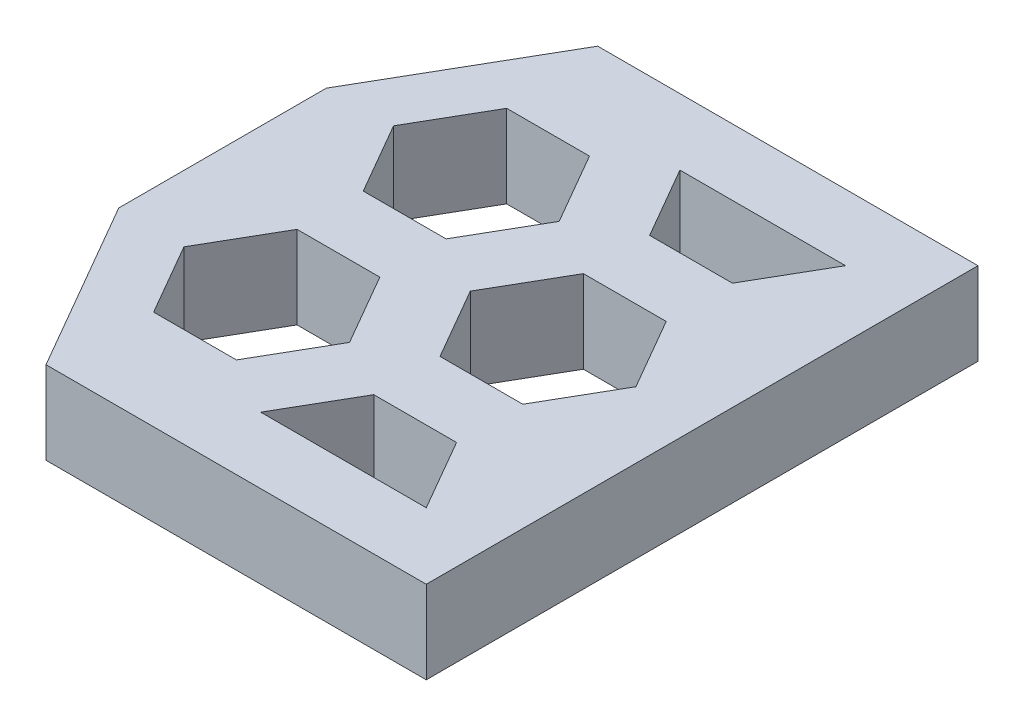
ISO-10303-21;
HEADER;
FILE_DESCRIPTION(('STEP AP214'),'2;1');
FILE_NAME('part.step','',(''),(''),'','','');
FILE_SCHEMA(('AUTOMOTIVE_DESIGN { 1 0 10303 214 1 1 1 1 }'));
ENDSEC;
DATA;
#1=APPLICATION_CONTEXT('core data for automotive mechanical design processes');
#2=APPLICATION_PROTOCOL_DEFINITION('international standard','automotive_design',2000,#1);
#3=PRODUCT_CONTEXT('',#1,'mechanical');
#4=PRODUCT('Part','Part','',(#3));
#5=PRODUCT_RELATED_PRODUCT_CATEGORY('part','',(#4));
#6=PRODUCT_DEFINITION_FORMATION('','',#4);
#7=PRODUCT_DEFINITION_CONTEXT('part definition',#1,'design');
#8=PRODUCT_DEFINITION('design','',#6,#7);
#9=PRODUCT_DEFINITION_SHAPE('','',#8);
#10=(LENGTH_UNIT() NAMED_UNIT(*) SI_UNIT(.MILLI.,.METRE.));
#11=(NAMED_UNIT(*) PLANE_ANGLE_UNIT() SI_UNIT($,.RADIAN.));
#12=(NAMED_UNIT(*) SI_UNIT($,.STERADIAN.) SOLID_ANGLE_UNIT());
#13=UNCERTAINTY_MEASURE_WITH_UNIT(LENGTH_MEASURE(1.E-05),#10,'distance_accuracy_value','');
#14=(GEOMETRIC_REPRESENTATION_CONTEXT(3) GLOBAL_UNCERTAINTY_ASSIGNED_CONTEXT((#13)) GLOBAL_UNIT_ASSIGNED_CONTEXT((#10,
#11,#12)) REPRESENTATION_CONTEXT('',''));
#15=CARTESIAN_POINT('',(0.,0.,0.));
#16=DIRECTION('',(0.,0.,1.));
#17=DIRECTION('',(1.,0.,0.));
#18=AXIS2_PLACEMENT_3D('',#15,#16,#17);
#19=CARTESIAN_POINT('',(0.,2.5,0.));
#20=DIRECTION('',(0.,-1.,0.));
#21=DIRECTION('',(0.,0.,-1.));
#22=AXIS2_PLACEMENT_3D('',#19,#20,#21);
#23=PLANE('',#22);
#24=DIRECTION('',(0.5,0.,-0.866025403784438));
#25=VECTOR('',#24,1.);
#26=CARTESIAN_POINT('',(11.2320508075689,2.5,-12.4951905283833));
#27=LINE('',#26,#25);
#28=CARTESIAN_POINT('',(11.2320508075689,2.5,-12.4951905283833));
#29=VERTEX_POINT('',#28);
#30=CARTESIAN_POINT('',(12.4820508075689,2.5,-14.6602540378444));
#31=VERTEX_POINT('',#30);
#32=EDGE_CURVE('E314',#29,#31,#27,.T.);
#33=ORIENTED_EDGE('',*,*,#32,.F.);
#34=DIRECTION('',(1.,0.,0.));
#35=VECTOR('',#34,1.);
#36=CARTESIAN_POINT('',(8.73205080756887,2.5,-12.4951905283833));
#37=LINE('',#36,#35);
#38=CARTESIAN_POINT('',(8.73205080756887,2.5,-12.4951905283833));
#39=VERTEX_POINT('',#38);
#40=EDGE_CURVE('E325',#39,#29,#37,.T.);
#41=ORIENTED_EDGE('',*,*,#40,.F.);
#42=DIRECTION('',(0.500000000000001,0.,0.866025403784438));
#43=VECTOR('',#42,1.);
#44=CARTESIAN_POINT('',(7.48205080756886,2.5,-14.6602540378444));
#45=LINE('',#44,#43);
#46=CARTESIAN_POINT('',(7.48205080756886,2.5,-14.6602540378444));
#47=VERTEX_POINT('',#46);
#48=EDGE_CURVE('E321',#47,#39,#45,.T.);
#49=ORIENTED_EDGE('',*,*,#48,.F.);
#50=DIRECTION('',(-1.,0.,0.));
#51=VECTOR('',#50,1.);
#52=CARTESIAN_POINT('',(7.48205080756886,2.5,-14.6602540378444));
#53=LINE('',#52,#51);
#54=EDGE_CURVE('E317',#31,#47,#53,.T.);
#55=ORIENTED_EDGE('',*,*,#54,.F.);
#56=EDGE_LOOP('',(#33,#41,#49,#55));
#57=FACE_BOUND('',#56,.T.);
#58=DIRECTION('',(0.5,0.,-0.866025403784439));
#59=VECTOR('',#58,1.);
#60=CARTESIAN_POINT('',(5.75,2.5,-2.99999999999998));
#61=LINE('',#60,#59);
#62=CARTESIAN_POINT('',(5.75,2.5,-2.99999999999998));
#63=VERTEX_POINT('',#62);
#64=CARTESIAN_POINT('',(7.,2.5,-5.16506350946108));
#65=VERTEX_POINT('',#64);
#66=EDGE_CURVE('E420',#63,#65,#61,.T.);
#67=ORIENTED_EDGE('',*,*,#66,.F.);
#68=DIRECTION('',(1.,0.,0.));
#69=VECTOR('',#68,1.);
#70=CARTESIAN_POINT('',(3.25,2.5,-2.99999999999998));
#71=LINE('',#70,#69);
#72=CARTESIAN_POINT('',(3.25,2.5,-2.99999999999998));
#73=VERTEX_POINT('',#72);
#74=EDGE_CURVE('E437',#73,#63,#71,.T.);
#75=ORIENTED_EDGE('',*,*,#74,.F.);
#76=DIRECTION('',(0.5,0.,0.866025403784439));
#77=VECTOR('',#76,1.);
#78=CARTESIAN_POINT('',(2.,2.5,-5.16506350946108));
#79=LINE('',#78,#77);
#80=CARTESIAN_POINT('',(2.,2.5,-5.16506350946108));
#81=VERTEX_POINT('',#80);
#82=EDGE_CURVE('E433',#81,#73,#79,.T.);
#83=ORIENTED_EDGE('',*,*,#82,.F.);
#84=DIRECTION('',(-0.5,0.,0.866025403784439));
#85=VECTOR('',#84,1.);
#86=CARTESIAN_POINT('',(3.25,2.5,-7.33012701892218));
#87=LINE('',#86,#85);
#88=CARTESIAN_POINT('',(3.25,2.5,-7.33012701892218));
#89=VERTEX_POINT('',#88);
#90=EDGE_CURVE('E430',#89,#81,#87,.T.);
#91=ORIENTED_EDGE('',*,*,#90,.F.);
#92=DIRECTION('',(-1.,0.,0.));
#93=VECTOR('',#92,1.);
#94=CARTESIAN_POINT('',(5.75,2.5,-7.33012701892218));
#95=LINE('',#94,#93);
#96=CARTESIAN_POINT('',(5.75,2.5,-7.33012701892218));
#97=VERTEX_POINT('',#96);
#98=EDGE_CURVE('E427',#97,#89,#95,.T.);
#99=ORIENTED_EDGE('',*,*,#98,.F.);
#100=DIRECTION('',(-0.5,0.,-0.866025403784439));
#101=VECTOR('',#100,1.);
#102=CARTESIAN_POINT('',(7.,2.5,-5.16506350946108));
#103=LINE('',#102,#101);
#104=EDGE_CURVE('E423',#65,#97,#103,.T.);
#105=ORIENTED_EDGE('',*,*,#104,.F.);
#106=EDGE_LOOP('',(#67,#75,#83,#91,#99,#105));
#107=FACE_BOUND('',#106,.T.);
#108=DIRECTION('',(0.,0.,1.));
#109=VECTOR('',#108,1.);
#110=CARTESIAN_POINT('',(0.,2.5,0.));
#111=LINE('',#110,#109);
#112=CARTESIAN_POINT('',(0.,2.5,-11.4641016151378));
#113=VERTEX_POINT('',#112);
#114=CARTESIAN_POINT('',(0.,2.5,-5.19615242270663));
#115=VERTEX_POINT('',#114);
#116=EDGE_CURVE('E546',#113,#115,#111,.T.);
#117=ORIENTED_EDGE('',*,*,#116,.T.);
#118=DIRECTION('',(-0.500000000000001,0.,-0.866025403784438));
#119=VECTOR('',#118,1.);
#120=CARTESIAN_POINT('',(3.00000000000001,2.5,0.));
#121=LINE('',#120,#119);
#122=CARTESIAN_POINT('',(3.00000000000001,2.5,0.));
#123=VERTEX_POINT('',#122);
#124=EDGE_CURVE('E57',#115,#123,#121,.F.);
#125=ORIENTED_EDGE('',*,*,#124,.T.);
#126=DIRECTION('',(1.,0.,0.));
#127=VECTOR('',#126,1.);
#128=CARTESIAN_POINT('',(0.,2.5,0.));
#129=LINE('',#128,#127);
#130=CARTESIAN_POINT('',(14.4820508075689,2.5,0.));
#131=VERTEX_POINT('',#130);
#132=EDGE_CURVE('E549',#123,#131,#129,.T.);
#133=ORIENTED_EDGE('',*,*,#132,.T.);
#134=DIRECTION('',(0.,0.,-1.));
#135=VECTOR('',#134,1.);
#136=CARTESIAN_POINT('',(14.4820508075689,2.5,0.));
#137=LINE('',#136,#135);
#138=CARTESIAN_POINT('',(14.4820508075689,2.5,-16.6602540378444));
#139=VERTEX_POINT('',#138);
#140=EDGE_CURVE('E553',#131,#139,#137,.T.);
#141=ORIENTED_EDGE('',*,*,#140,.T.);
#142=DIRECTION('',(-1.,0.,0.));
#143=VECTOR('',#142,1.);
#144=CARTESIAN_POINT('',(0.,2.5,-16.6602540378444));
#145=LINE('',#144,#143);
#146=CARTESIAN_POINT('',(3.,2.5,-16.6602540378444));
#147=VERTEX_POINT('',#146);
#148=EDGE_CURVE('E556',#139,#147,#145,.T.);
#149=ORIENTED_EDGE('',*,*,#148,.T.);
#150=DIRECTION('',(0.500000000000001,0.,-0.866025403784438));
#151=VECTOR('',#150,1.);
#152=CARTESIAN_POINT('',(0.,2.5,-11.4641016151378));
#153=LINE('',#152,#151);
#154=EDGE_CURVE('E593',#147,#113,#153,.F.);
#155=ORIENTED_EDGE('',*,*,#154,.T.);
#156=EDGE_LOOP('',(#117,#125,#133,#141,#149,#155));
#157=FACE_BOUND('',#156,.T.);
#158=DIRECTION('',(0.5,0.,-0.866025403784439));
#159=VECTOR('',#158,1.);
#160=CARTESIAN_POINT('',(5.74999999999999,2.5,-9.33012701892219));
#161=LINE('',#160,#159);
#162=CARTESIAN_POINT('',(5.74999999999999,2.5,-9.33012701892219));
#163=VERTEX_POINT('',#162);
#164=CARTESIAN_POINT('',(6.99999999999999,2.5,-11.4951905283833));
#165=VERTEX_POINT('',#164);
#166=EDGE_CURVE('E483',#163,#165,#161,.T.);
#167=ORIENTED_EDGE('',*,*,#166,.F.);
#168=DIRECTION('',(1.,0.,0.));
#169=VECTOR('',#168,1.);
#170=CARTESIAN_POINT('',(3.25,2.5,-9.33012701892219));
#171=LINE('',#170,#169);
#172=CARTESIAN_POINT('',(3.25,2.5,-9.33012701892219));
#173=VERTEX_POINT('',#172);
#174=EDGE_CURVE('E500',#173,#163,#171,.T.);
#175=ORIENTED_EDGE('',*,*,#174,.F.);
#176=DIRECTION('',(0.5,0.,0.866025403784439));
#177=VECTOR('',#176,1.);
#178=CARTESIAN_POINT('',(2.,2.5,-11.4951905283833));
#179=LINE('',#178,#177);
#180=CARTESIAN_POINT('',(2.,2.5,-11.4951905283833));
#181=VERTEX_POINT('',#180);
#182=EDGE_CURVE('E496',#181,#173,#179,.T.);
#183=ORIENTED_EDGE('',*,*,#182,.F.);
#184=DIRECTION('',(-0.5,0.,0.866025403784439));
#185=VECTOR('',#184,1.);
#186=CARTESIAN_POINT('',(3.25,2.5,-13.6602540378444));
#187=LINE('',#186,#185);
#188=CARTESIAN_POINT('',(3.25,2.5,-13.6602540378444));
#189=VERTEX_POINT('',#188);
#190=EDGE_CURVE('E493',#189,#181,#187,.T.);
#191=ORIENTED_EDGE('',*,*,#190,.F.);
#192=DIRECTION('',(-1.,0.,0.));
#193=VECTOR('',#192,1.);
#194=CARTESIAN_POINT('',(5.75,2.5,-13.6602540378444));
#195=LINE('',#194,#193);
#196=CARTESIAN_POINT('',(5.75,2.5,-13.6602540378444));
#197=VERTEX_POINT('',#196);
#198=EDGE_CURVE('E490',#197,#189,#195,.T.);
#199=ORIENTED_EDGE('',*,*,#198,.F.);
#200=DIRECTION('',(-0.5,0.,-0.866025403784438));
#201=VECTOR('',#200,1.);
#202=CARTESIAN_POINT('',(6.99999999999999,2.5,-11.4951905283833));
#203=LINE('',#202,#201);
#204=EDGE_CURVE('E486',#165,#197,#203,.T.);
#205=ORIENTED_EDGE('',*,*,#204,.F.);
#206=EDGE_LOOP('',(#167,#175,#183,#191,#199,#205));
#207=FACE_BOUND('',#206,.T.);
#208=DIRECTION('',(0.5,0.,-0.866025403784439));
#209=VECTOR('',#208,1.);
#210=CARTESIAN_POINT('',(11.2320508075689,2.5,-6.1650635094611));
#211=LINE('',#210,#209);
#212=CARTESIAN_POINT('',(11.2320508075689,2.5,-6.1650635094611));
#213=VERTEX_POINT('',#212);
#214=CARTESIAN_POINT('',(12.4820508075689,2.5,-8.33012701892219));
#215=VERTEX_POINT('',#214);
#216=EDGE_CURVE('E357',#213,#215,#211,.T.);
#217=ORIENTED_EDGE('',*,*,#216,.F.);
#218=DIRECTION('',(1.,0.,0.));
#219=VECTOR('',#218,1.);
#220=CARTESIAN_POINT('',(8.73205080756887,2.5,-6.1650635094611));
#221=LINE('',#220,#219);
#222=CARTESIAN_POINT('',(8.73205080756887,2.5,-6.1650635094611));
#223=VERTEX_POINT('',#222);
#224=EDGE_CURVE('E374',#223,#213,#221,.T.);
#225=ORIENTED_EDGE('',*,*,#224,.F.);
#226=DIRECTION('',(0.5,0.,0.866025403784439));
#227=VECTOR('',#226,1.);
#228=CARTESIAN_POINT('',(7.48205080756887,2.5,-8.33012701892219));
#229=LINE('',#228,#227);
#230=CARTESIAN_POINT('',(7.48205080756887,2.5,-8.33012701892219));
#231=VERTEX_POINT('',#230);
#232=EDGE_CURVE('E370',#231,#223,#229,.T.);
#233=ORIENTED_EDGE('',*,*,#232,.F.);
#234=DIRECTION('',(-0.5,0.,0.866025403784439));
#235=VECTOR('',#234,1.);
#236=CARTESIAN_POINT('',(8.73205080756887,2.5,-10.4951905283833));
#237=LINE('',#236,#235);
#238=CARTESIAN_POINT('',(8.73205080756887,2.5,-10.4951905283833));
#239=VERTEX_POINT('',#238);
#240=EDGE_CURVE('E367',#239,#231,#237,.T.);
#241=ORIENTED_EDGE('',*,*,#240,.F.);
#242=DIRECTION('',(-1.,0.,0.));
#243=VECTOR('',#242,1.);
#244=CARTESIAN_POINT('',(11.2320508075689,2.5,-10.4951905283833));
#245=LINE('',#244,#243);
#246=CARTESIAN_POINT('',(11.2320508075689,2.5,-10.4951905283833));
#247=VERTEX_POINT('',#246);
#248=EDGE_CURVE('E364',#247,#239,#245,.T.);
#249=ORIENTED_EDGE('',*,*,#248,.F.);
#250=DIRECTION('',(-0.5,0.,-0.866025403784438));
#251=VECTOR('',#250,1.);
#252=CARTESIAN_POINT('',(12.4820508075689,2.5,-8.33012701892219));
#253=LINE('',#252,#251);
#254=EDGE_CURVE('E360',#215,#247,#253,.T.);
#255=ORIENTED_EDGE('',*,*,#254,.F.);
#256=EDGE_LOOP('',(#217,#225,#233,#241,#249,#255));
#257=FACE_BOUND('',#256,.T.);
#258=DIRECTION('',(-0.499999999999999,0.,-0.866025403784439));
#259=VECTOR('',#258,1.);
#260=CARTESIAN_POINT('',(12.4820508075689,2.5,-2.));
#261=LINE('',#260,#259);
#262=CARTESIAN_POINT('',(12.4820508075689,2.5,-2.));
#263=VERTEX_POINT('',#262);
#264=CARTESIAN_POINT('',(11.2320508075689,2.5,-4.1650635094611));
#265=VERTEX_POINT('',#264);
#266=EDGE_CURVE('E261',#263,#265,#261,.T.);
#267=ORIENTED_EDGE('',*,*,#266,.F.);
#268=DIRECTION('',(1.,0.,0.));
#269=VECTOR('',#268,1.);
#270=CARTESIAN_POINT('',(7.48205080756889,2.5,-2.));
#271=LINE('',#270,#269);
#272=CARTESIAN_POINT('',(7.48205080756889,2.5,-2.));
#273=VERTEX_POINT('',#272);
#274=EDGE_CURVE('E290',#273,#263,#271,.T.);
#275=ORIENTED_EDGE('',*,*,#274,.F.);
#276=DIRECTION('',(-0.5,0.,0.866025403784439));
#277=VECTOR('',#276,1.);
#278=CARTESIAN_POINT('',(8.73205080756889,2.5,-4.1650635094611));
#279=LINE('',#278,#277);
#280=CARTESIAN_POINT('',(8.73205080756889,2.5,-4.1650635094611));
#281=VERTEX_POINT('',#280);
#282=EDGE_CURVE('E286',#281,#273,#279,.T.);
#283=ORIENTED_EDGE('',*,*,#282,.F.);
#284=DIRECTION('',(-1.,0.,0.));
#285=VECTOR('',#284,1.);
#286=CARTESIAN_POINT('',(11.2320508075689,2.5,-4.1650635094611));
#287=LINE('',#286,#285);
#288=EDGE_CURVE('E272',#265,#281,#287,.T.);
#289=ORIENTED_EDGE('',*,*,#288,.F.);
#290=EDGE_LOOP('',(#267,#275,#283,#289));
#291=FACE_BOUND('',#290,.T.);
#292=ADVANCED_FACE('F47',(#57,#107,#157,#207,#257,#291),#23,.F.);
#293=CARTESIAN_POINT('',(0.,0.,0.));
#294=DIRECTION('',(0.,-1.,0.));
#295=DIRECTION('',(0.,0.,-1.));
#296=AXIS2_PLACEMENT_3D('',#293,#294,#295);
#297=PLANE('',#296);
#298=DIRECTION('',(1.,0.,0.));
#299=VECTOR('',#298,1.);
#300=CARTESIAN_POINT('',(0.,0.,0.));
#301=LINE('',#300,#299);
#302=CARTESIAN_POINT('',(3.00000000000001,0.,0.));
#303=VERTEX_POINT('',#302);
#304=CARTESIAN_POINT('',(14.4820508075689,0.,0.));
#305=VERTEX_POINT('',#304);
#306=EDGE_CURVE('E562',#303,#305,#301,.T.);
#307=ORIENTED_EDGE('',*,*,#306,.F.);
#308=DIRECTION('',(0.500000000000001,0.,0.866025403784438));
#309=VECTOR('',#308,1.);
#310=CARTESIAN_POINT('',(2.25,0.,-1.29903810567666));
#311=LINE('',#310,#309);
#312=CARTESIAN_POINT('',(0.,0.,-5.19615242270663));
#313=VERTEX_POINT('',#312);
#314=EDGE_CURVE('E584',#303,#313,#311,.F.);
#315=ORIENTED_EDGE('',*,*,#314,.T.);
#316=DIRECTION('',(0.,0.,1.));
#317=VECTOR('',#316,1.);
#318=CARTESIAN_POINT('',(0.,0.,0.));
#319=LINE('',#318,#317);
#320=CARTESIAN_POINT('',(0.,0.,-11.4641016151378));
#321=VERTEX_POINT('',#320);
#322=EDGE_CURVE('E545',#321,#313,#319,.T.);
#323=ORIENTED_EDGE('',*,*,#322,.F.);
#324=DIRECTION('',(-0.500000000000001,0.,0.866025403784438));
#325=VECTOR('',#324,1.);
#326=CARTESIAN_POINT('',(-4.96410161513776,0.,-2.86602540378445));
#327=LINE('',#326,#325);
#328=CARTESIAN_POINT('',(3.,0.,-16.6602540378444));
#329=VERTEX_POINT('',#328);
#330=EDGE_CURVE('E581',#321,#329,#327,.F.);
#331=ORIENTED_EDGE('',*,*,#330,.T.);
#332=DIRECTION('',(-1.,0.,0.));
#333=VECTOR('',#332,1.);
#334=CARTESIAN_POINT('',(0.,0.,-16.6602540378444));
#335=LINE('',#334,#333);
#336=CARTESIAN_POINT('',(14.4820508075689,0.,-16.6602540378444));
#337=VERTEX_POINT('',#336);
#338=EDGE_CURVE('E550',#337,#329,#335,.T.);
#339=ORIENTED_EDGE('',*,*,#338,.F.);
#340=DIRECTION('',(0.,0.,-1.));
#341=VECTOR('',#340,1.);
#342=CARTESIAN_POINT('',(14.4820508075689,0.,0.));
#343=LINE('',#342,#341);
#344=EDGE_CURVE('E565',#305,#337,#343,.T.);
#345=ORIENTED_EDGE('',*,*,#344,.F.);
#346=EDGE_LOOP('',(#307,#315,#323,#331,#339,#345));
#347=FACE_BOUND('',#346,.T.);
#348=DIRECTION('',(1.,0.,0.));
#349=VECTOR('',#348,1.);
#350=CARTESIAN_POINT('',(3.25,0.,-9.33012701892219));
#351=LINE('',#350,#349);
#352=CARTESIAN_POINT('',(3.25,0.,-9.33012701892219));
#353=VERTEX_POINT('',#352);
#354=CARTESIAN_POINT('',(5.74999999999999,0.,-9.33012701892219));
#355=VERTEX_POINT('',#354);
#356=EDGE_CURVE('E487',#353,#355,#351,.T.);
#357=ORIENTED_EDGE('',*,*,#356,.T.);
#358=DIRECTION('',(0.5,0.,-0.866025403784439));
#359=VECTOR('',#358,1.);
#360=CARTESIAN_POINT('',(5.74999999999999,0.,-9.33012701892219));
#361=LINE('',#360,#359);
#362=CARTESIAN_POINT('',(6.99999999999999,0.,-11.4951905283833));
#363=VERTEX_POINT('',#362);
#364=EDGE_CURVE('E482',#355,#363,#361,.T.);
#365=ORIENTED_EDGE('',*,*,#364,.T.);
#366=DIRECTION('',(-0.5,0.,-0.866025403784438));
#367=VECTOR('',#366,1.);
#368=CARTESIAN_POINT('',(6.99999999999999,0.,-11.4951905283833));
#369=LINE('',#368,#367);
#370=CARTESIAN_POINT('',(5.75,0.,-13.6602540378444));
#371=VERTEX_POINT('',#370);
#372=EDGE_CURVE('E507',#363,#371,#369,.T.);
#373=ORIENTED_EDGE('',*,*,#372,.T.);
#374=DIRECTION('',(-1.,0.,0.));
#375=VECTOR('',#374,1.);
#376=CARTESIAN_POINT('',(5.75,0.,-13.6602540378444));
#377=LINE('',#376,#375);
#378=CARTESIAN_POINT('',(3.25,0.,-13.6602540378444));
#379=VERTEX_POINT('',#378);
#380=EDGE_CURVE('E511',#371,#379,#377,.T.);
#381=ORIENTED_EDGE('',*,*,#380,.T.);
#382=DIRECTION('',(-0.5,0.,0.866025403784439));
#383=VECTOR('',#382,1.);
#384=CARTESIAN_POINT('',(3.25,0.,-13.6602540378444));
#385=LINE('',#384,#383);
#386=CARTESIAN_POINT('',(2.,0.,-11.4951905283833));
#387=VERTEX_POINT('',#386);
#388=EDGE_CURVE('E515',#379,#387,#385,.T.);
#389=ORIENTED_EDGE('',*,*,#388,.T.);
#390=DIRECTION('',(0.5,0.,0.866025403784439));
#391=VECTOR('',#390,1.);
#392=CARTESIAN_POINT('',(2.,0.,-11.4951905283833));
#393=LINE('',#392,#391);
#394=EDGE_CURVE('E519',#387,#353,#393,.T.);
#395=ORIENTED_EDGE('',*,*,#394,.T.);
#396=EDGE_LOOP('',(#357,#365,#373,#381,#389,#395));
#397=FACE_BOUND('',#396,.T.);
#398=DIRECTION('',(1.,0.,0.));
#399=VECTOR('',#398,1.);
#400=CARTESIAN_POINT('',(3.25,0.,-2.99999999999998));
#401=LINE('',#400,#399);
#402=CARTESIAN_POINT('',(3.25,0.,-2.99999999999998));
#403=VERTEX_POINT('',#402);
#404=CARTESIAN_POINT('',(5.75,0.,-2.99999999999998));
#405=VERTEX_POINT('',#404);
#406=EDGE_CURVE('E424',#403,#405,#401,.T.);
#407=ORIENTED_EDGE('',*,*,#406,.T.);
#408=DIRECTION('',(0.5,0.,-0.866025403784439));
#409=VECTOR('',#408,1.);
#410=CARTESIAN_POINT('',(5.75,0.,-2.99999999999998));
#411=LINE('',#410,#409);
#412=CARTESIAN_POINT('',(7.,0.,-5.16506350946108));
#413=VERTEX_POINT('',#412);
#414=EDGE_CURVE('E419',#405,#413,#411,.T.);
#415=ORIENTED_EDGE('',*,*,#414,.T.);
#416=DIRECTION('',(-0.5,0.,-0.866025403784439));
#417=VECTOR('',#416,1.);
#418=CARTESIAN_POINT('',(7.,0.,-5.16506350946108));
#419=LINE('',#418,#417);
#420=CARTESIAN_POINT('',(5.75,0.,-7.33012701892218));
#421=VERTEX_POINT('',#420);
#422=EDGE_CURVE('E444',#413,#421,#419,.T.);
#423=ORIENTED_EDGE('',*,*,#422,.T.);
#424=DIRECTION('',(-1.,0.,0.));
#425=VECTOR('',#424,1.);
#426=CARTESIAN_POINT('',(5.75,0.,-7.33012701892218));
#427=LINE('',#426,#425);
#428=CARTESIAN_POINT('',(3.25,0.,-7.33012701892218));
#429=VERTEX_POINT('',#428);
#430=EDGE_CURVE('E448',#421,#429,#427,.T.);
#431=ORIENTED_EDGE('',*,*,#430,.T.);
#432=DIRECTION('',(-0.5,0.,0.866025403784439));
#433=VECTOR('',#432,1.);
#434=CARTESIAN_POINT('',(3.25,0.,-7.33012701892218));
#435=LINE('',#434,#433);
#436=CARTESIAN_POINT('',(2.,0.,-5.16506350946108));
#437=VERTEX_POINT('',#436);
#438=EDGE_CURVE('E452',#429,#437,#435,.T.);
#439=ORIENTED_EDGE('',*,*,#438,.T.);
#440=DIRECTION('',(0.5,0.,0.866025403784439));
#441=VECTOR('',#440,1.);
#442=CARTESIAN_POINT('',(2.,0.,-5.16506350946108));
#443=LINE('',#442,#441);
#444=EDGE_CURVE('E456',#437,#403,#443,.T.);
#445=ORIENTED_EDGE('',*,*,#444,.T.);
#446=EDGE_LOOP('',(#407,#415,#423,#431,#439,#445));
#447=FACE_BOUND('',#446,.T.);
#448=DIRECTION('',(1.,0.,0.));
#449=VECTOR('',#448,1.);
#450=CARTESIAN_POINT('',(8.73205080756887,0.,-6.1650635094611));
#451=LINE('',#450,#449);
#452=CARTESIAN_POINT('',(8.73205080756887,0.,-6.1650635094611));
#453=VERTEX_POINT('',#452);
#454=CARTESIAN_POINT('',(11.2320508075689,0.,-6.1650635094611));
#455=VERTEX_POINT('',#454);
#456=EDGE_CURVE('E361',#453,#455,#451,.T.);
#457=ORIENTED_EDGE('',*,*,#456,.T.);
#458=DIRECTION('',(0.5,0.,-0.866025403784439));
#459=VECTOR('',#458,1.);
#460=CARTESIAN_POINT('',(11.2320508075689,0.,-6.1650635094611));
#461=LINE('',#460,#459);
#462=CARTESIAN_POINT('',(12.4820508075689,0.,-8.33012701892219));
#463=VERTEX_POINT('',#462);
#464=EDGE_CURVE('E356',#455,#463,#461,.T.);
#465=ORIENTED_EDGE('',*,*,#464,.T.);
#466=DIRECTION('',(-0.5,0.,-0.866025403784438));
#467=VECTOR('',#466,1.);
#468=CARTESIAN_POINT('',(12.4820508075689,0.,-8.33012701892219));
#469=LINE('',#468,#467);
#470=CARTESIAN_POINT('',(11.2320508075689,0.,-10.4951905283833));
#471=VERTEX_POINT('',#470);
#472=EDGE_CURVE('E381',#463,#471,#469,.T.);
#473=ORIENTED_EDGE('',*,*,#472,.T.);
#474=DIRECTION('',(-1.,0.,0.));
#475=VECTOR('',#474,1.);
#476=CARTESIAN_POINT('',(11.2320508075689,0.,-10.4951905283833));
#477=LINE('',#476,#475);
#478=CARTESIAN_POINT('',(8.73205080756887,0.,-10.4951905283833));
#479=VERTEX_POINT('',#478);
#480=EDGE_CURVE('E385',#471,#479,#477,.T.);
#481=ORIENTED_EDGE('',*,*,#480,.T.);
#482=DIRECTION('',(-0.5,0.,0.866025403784439));
#483=VECTOR('',#482,1.);
#484=CARTESIAN_POINT('',(8.73205080756887,0.,-10.4951905283833));
#485=LINE('',#484,#483);
#486=CARTESIAN_POINT('',(7.48205080756887,0.,-8.33012701892219));
#487=VERTEX_POINT('',#486);
#488=EDGE_CURVE('E389',#479,#487,#485,.T.);
#489=ORIENTED_EDGE('',*,*,#488,.T.);
#490=DIRECTION('',(0.5,0.,0.866025403784439));
#491=VECTOR('',#490,1.);
#492=CARTESIAN_POINT('',(7.48205080756887,0.,-8.33012701892219));
#493=LINE('',#492,#491);
#494=EDGE_CURVE('E393',#487,#453,#493,.T.);
#495=ORIENTED_EDGE('',*,*,#494,.T.);
#496=EDGE_LOOP('',(#457,#465,#473,#481,#489,#495));
#497=FACE_BOUND('',#496,.T.);
#498=DIRECTION('',(1.,0.,0.));
#499=VECTOR('',#498,1.);
#500=CARTESIAN_POINT('',(8.73205080756887,0.,-12.4951905283833));
#501=LINE('',#500,#499);
#502=CARTESIAN_POINT('',(8.73205080756887,0.,-12.4951905283833));
#503=VERTEX_POINT('',#502);
#504=CARTESIAN_POINT('',(11.2320508075689,0.,-12.4951905283833));
#505=VERTEX_POINT('',#504);
#506=EDGE_CURVE('E318',#503,#505,#501,.T.);
#507=ORIENTED_EDGE('',*,*,#506,.T.);
#508=DIRECTION('',(0.5,0.,-0.866025403784438));
#509=VECTOR('',#508,1.);
#510=CARTESIAN_POINT('',(11.2320508075689,0.,-12.4951905283833));
#511=LINE('',#510,#509);
#512=CARTESIAN_POINT('',(12.4820508075689,0.,-14.6602540378444));
#513=VERTEX_POINT('',#512);
#514=EDGE_CURVE('E281',#505,#513,#511,.T.);
#515=ORIENTED_EDGE('',*,*,#514,.T.);
#516=DIRECTION('',(-1.,0.,0.));
#517=VECTOR('',#516,1.);
#518=CARTESIAN_POINT('',(7.48205080756886,0.,-14.6602540378444));
#519=LINE('',#518,#517);
#520=CARTESIAN_POINT('',(7.48205080756886,0.,-14.6602540378444));
#521=VERTEX_POINT('',#520);
#522=EDGE_CURVE('E332',#513,#521,#519,.T.);
#523=ORIENTED_EDGE('',*,*,#522,.T.);
#524=DIRECTION('',(0.500000000000001,0.,0.866025403784438));
#525=VECTOR('',#524,1.);
#526=CARTESIAN_POINT('',(7.48205080756886,0.,-14.6602540378444));
#527=LINE('',#526,#525);
#528=EDGE_CURVE('E336',#521,#503,#527,.T.);
#529=ORIENTED_EDGE('',*,*,#528,.T.);
#530=EDGE_LOOP('',(#507,#515,#523,#529));
#531=FACE_BOUND('',#530,.T.);
#532=DIRECTION('',(1.,0.,0.));
#533=VECTOR('',#532,1.);
#534=CARTESIAN_POINT('',(7.48205080756889,0.,-2.));
#535=LINE('',#534,#533);
#536=CARTESIAN_POINT('',(7.48205080756889,0.,-2.));
#537=VERTEX_POINT('',#536);
#538=CARTESIAN_POINT('',(12.4820508075689,0.,-2.));
#539=VERTEX_POINT('',#538);
#540=EDGE_CURVE('E273',#537,#539,#535,.T.);
#541=ORIENTED_EDGE('',*,*,#540,.T.);
#542=DIRECTION('',(-0.499999999999999,0.,-0.866025403784439));
#543=VECTOR('',#542,1.);
#544=CARTESIAN_POINT('',(12.4820508075689,0.,-2.));
#545=LINE('',#544,#543);
#546=CARTESIAN_POINT('',(11.2320508075689,0.,-4.1650635094611));
#547=VERTEX_POINT('',#546);
#548=EDGE_CURVE('E295',#539,#547,#545,.T.);
#549=ORIENTED_EDGE('',*,*,#548,.T.);
#550=DIRECTION('',(-1.,0.,0.));
#551=VECTOR('',#550,1.);
#552=CARTESIAN_POINT('',(11.2320508075689,0.,-4.1650635094611));
#553=LINE('',#552,#551);
#554=CARTESIAN_POINT('',(8.73205080756889,0.,-4.1650635094611));
#555=VERTEX_POINT('',#554);
#556=EDGE_CURVE('E279',#547,#555,#553,.T.);
#557=ORIENTED_EDGE('',*,*,#556,.T.);
#558=DIRECTION('',(-0.5,0.,0.866025403784439));
#559=VECTOR('',#558,1.);
#560=CARTESIAN_POINT('',(8.73205080756889,0.,-4.1650635094611));
#561=LINE('',#560,#559);
#562=EDGE_CURVE('E300',#555,#537,#561,.T.);
#563=ORIENTED_EDGE('',*,*,#562,.T.);
#564=EDGE_LOOP('',(#541,#549,#557,#563));
#565=FACE_BOUND('',#564,.T.);
#566=ADVANCED_FACE('F610',(#347,#397,#447,#497,#531,#565),#297,.T.);
#567=CARTESIAN_POINT('',(0.,2.5,0.));
#568=DIRECTION('',(1.,0.,0.));
#569=DIRECTION('',(0.,0.,-1.));
#570=AXIS2_PLACEMENT_3D('',#567,#568,#569);
#571=PLANE('',#570);
#572=ORIENTED_EDGE('',*,*,#322,.T.);
#573=DIRECTION('',(0.,1.,0.));
#574=VECTOR('',#573,1.);
#575=CARTESIAN_POINT('',(0.,2.5,-5.19615242270663));
#576=LINE('',#575,#574);
#577=EDGE_CURVE('E70',#313,#115,#576,.T.);
#578=ORIENTED_EDGE('',*,*,#577,.T.);
#579=ORIENTED_EDGE('',*,*,#116,.F.);
#580=DIRECTION('',(0.,-1.,0.));
#581=VECTOR('',#580,1.);
#582=CARTESIAN_POINT('',(0.,2.5,-11.4641016151378));
#583=LINE('',#582,#581);
#584=EDGE_CURVE('E587',#113,#321,#583,.T.);
#585=ORIENTED_EDGE('',*,*,#584,.T.);
#586=EDGE_LOOP('',(#572,#578,#579,#585));
#587=FACE_BOUND('',#586,.T.);
#588=ADVANCED_FACE('F613',(#587),#571,.F.);
#589=CARTESIAN_POINT('',(0.,2.5,0.));
#590=DIRECTION('',(0.,0.,-1.));
#591=DIRECTION('',(-1.,0.,0.));
#592=AXIS2_PLACEMENT_3D('',#589,#590,#591);
#593=PLANE('',#592);
#594=ORIENTED_EDGE('',*,*,#132,.F.);
#595=DIRECTION('',(0.,-1.,0.));
#596=VECTOR('',#595,1.);
#597=CARTESIAN_POINT('',(3.00000000000001,2.5,0.));
#598=LINE('',#597,#596);
#599=EDGE_CURVE('E577',#123,#303,#598,.T.);
#600=ORIENTED_EDGE('',*,*,#599,.T.);
#601=ORIENTED_EDGE('',*,*,#306,.T.);
#602=DIRECTION('',(0.,-1.,0.));
#603=VECTOR('',#602,1.);
#604=CARTESIAN_POINT('',(14.4820508075689,2.5,0.));
#605=LINE('',#604,#603);
#606=EDGE_CURVE('E573',#131,#305,#605,.T.);
#607=ORIENTED_EDGE('',*,*,#606,.F.);
#608=EDGE_LOOP('',(#594,#600,#601,#607));
#609=FACE_BOUND('',#608,.T.);
#610=ADVANCED_FACE('F604',(#609),#593,.F.);
#611=CARTESIAN_POINT('',(14.4820508075689,2.5,0.));
#612=DIRECTION('',(-1.,0.,0.));
#613=DIRECTION('',(0.,0.,1.));
#614=AXIS2_PLACEMENT_3D('',#611,#612,#613);
#615=PLANE('',#614);
#616=ORIENTED_EDGE('',*,*,#344,.T.);
#617=DIRECTION('',(0.,-1.,0.));
#618=VECTOR('',#617,1.);
#619=CARTESIAN_POINT('',(14.4820508075689,2.5,-16.6602540378444));
#620=LINE('',#619,#618);
#621=EDGE_CURVE('E559',#139,#337,#620,.T.);
#622=ORIENTED_EDGE('',*,*,#621,.F.);
#623=ORIENTED_EDGE('',*,*,#140,.F.);
#624=ORIENTED_EDGE('',*,*,#606,.T.);
#625=EDGE_LOOP('',(#616,#622,#623,#624));
#626=FACE_BOUND('',#625,.T.);
#627=ADVANCED_FACE('F621',(#626),#615,.F.);
#628=CARTESIAN_POINT('',(0.,2.5,-16.6602540378444));
#629=DIRECTION('',(0.,0.,1.));
#630=DIRECTION('',(1.,0.,0.));
#631=AXIS2_PLACEMENT_3D('',#628,#629,#630);
#632=PLANE('',#631);
#633=ORIENTED_EDGE('',*,*,#338,.T.);
#634=DIRECTION('',(0.,1.,0.));
#635=VECTOR('',#634,1.);
#636=CARTESIAN_POINT('',(3.,2.5,-16.6602540378444));
#637=LINE('',#636,#635);
#638=EDGE_CURVE('E11',#329,#147,#637,.T.);
#639=ORIENTED_EDGE('',*,*,#638,.T.);
#640=ORIENTED_EDGE('',*,*,#148,.F.);
#641=ORIENTED_EDGE('',*,*,#621,.T.);
#642=EDGE_LOOP('',(#633,#639,#640,#641));
#643=FACE_BOUND('',#642,.T.);
#644=ADVANCED_FACE('F618',(#643),#632,.F.);
#645=CARTESIAN_POINT('',(5.74999999999999,2.5,-9.33012701892219));
#646=DIRECTION('',(-0.866025403784439,0.,-0.5));
#647=DIRECTION('',(-0.5,0.,0.866025403784439));
#648=AXIS2_PLACEMENT_3D('',#645,#646,#647);
#649=PLANE('',#648);
#650=ORIENTED_EDGE('',*,*,#364,.F.);
#651=DIRECTION('',(0.,-1.,0.));
#652=VECTOR('',#651,1.);
#653=CARTESIAN_POINT('',(5.74999999999999,2.5,-9.33012701892219));
#654=LINE('',#653,#652);
#655=EDGE_CURVE('E503',#163,#355,#654,.T.);
#656=ORIENTED_EDGE('',*,*,#655,.F.);
#657=ORIENTED_EDGE('',*,*,#166,.T.);
#658=DIRECTION('',(0.,-1.,0.));
#659=VECTOR('',#658,1.);
#660=CARTESIAN_POINT('',(6.99999999999999,2.5,-11.4951905283833));
#661=LINE('',#660,#659);
#662=EDGE_CURVE('E541',#165,#363,#661,.T.);
#663=ORIENTED_EDGE('',*,*,#662,.T.);
#664=EDGE_LOOP('',(#650,#656,#657,#663));
#665=FACE_BOUND('',#664,.T.);
#666=ADVANCED_FACE('F628',(#665),#649,.T.);
#667=CARTESIAN_POINT('',(6.99999999999999,2.5,-11.4951905283833));
#668=DIRECTION('',(-0.866025403784438,0.,0.5));
#669=DIRECTION('',(0.5,0.,0.866025403784438));
#670=AXIS2_PLACEMENT_3D('',#667,#668,#669);
#671=PLANE('',#670);
#672=ORIENTED_EDGE('',*,*,#372,.F.);
#673=ORIENTED_EDGE('',*,*,#662,.F.);
#674=ORIENTED_EDGE('',*,*,#204,.T.);
#675=DIRECTION('',(0.,-1.,0.));
#676=VECTOR('',#675,1.);
#677=CARTESIAN_POINT('',(5.75,2.5,-13.6602540378444));
#678=LINE('',#677,#676);
#679=EDGE_CURVE('E538',#197,#371,#678,.T.);
#680=ORIENTED_EDGE('',*,*,#679,.T.);
#681=EDGE_LOOP('',(#672,#673,#674,#680));
#682=FACE_BOUND('',#681,.T.);
#683=ADVANCED_FACE('F644',(#682),#671,.T.);
#684=CARTESIAN_POINT('',(5.75,2.5,-13.6602540378444));
#685=DIRECTION('',(0.,0.,1.));
#686=DIRECTION('',(1.,0.,0.));
#687=AXIS2_PLACEMENT_3D('',#684,#685,#686);
#688=PLANE('',#687);
#689=ORIENTED_EDGE('',*,*,#380,.F.);
#690=ORIENTED_EDGE('',*,*,#679,.F.);
#691=ORIENTED_EDGE('',*,*,#198,.T.);
#692=DIRECTION('',(0.,-1.,0.));
#693=VECTOR('',#692,1.);
#694=CARTESIAN_POINT('',(3.25,2.5,-13.6602540378444));
#695=LINE('',#694,#693);
#696=EDGE_CURVE('E535',#189,#379,#695,.T.);
#697=ORIENTED_EDGE('',*,*,#696,.T.);
#698=EDGE_LOOP('',(#689,#690,#691,#697));
#699=FACE_BOUND('',#698,.T.);
#700=ADVANCED_FACE('F648',(#699),#688,.T.);
#701=CARTESIAN_POINT('',(3.25,2.5,-13.6602540378444));
#702=DIRECTION('',(0.866025403784439,0.,0.5));
#703=DIRECTION('',(0.5,0.,-0.866025403784439));
#704=AXIS2_PLACEMENT_3D('',#701,#702,#703);
#705=PLANE('',#704);
#706=ORIENTED_EDGE('',*,*,#388,.F.);
#707=ORIENTED_EDGE('',*,*,#696,.F.);
#708=ORIENTED_EDGE('',*,*,#190,.T.);
#709=DIRECTION('',(0.,-1.,0.));
#710=VECTOR('',#709,1.);
#711=CARTESIAN_POINT('',(2.,2.5,-11.4951905283833));
#712=LINE('',#711,#710);
#713=EDGE_CURVE('E532',#181,#387,#712,.T.);
#714=ORIENTED_EDGE('',*,*,#713,.T.);
#715=EDGE_LOOP('',(#706,#707,#708,#714));
#716=FACE_BOUND('',#715,.T.);
#717=ADVANCED_FACE('F652',(#716),#705,.T.);
#718=CARTESIAN_POINT('',(2.,2.5,-11.4951905283833));
#719=DIRECTION('',(0.866025403784439,0.,-0.5));
#720=DIRECTION('',(-0.5,0.,-0.866025403784439));
#721=AXIS2_PLACEMENT_3D('',#718,#719,#720);
#722=PLANE('',#721);
#723=ORIENTED_EDGE('',*,*,#394,.F.);
#724=ORIENTED_EDGE('',*,*,#713,.F.);
#725=ORIENTED_EDGE('',*,*,#182,.T.);
#726=DIRECTION('',(0.,-1.,0.));
#727=VECTOR('',#726,1.);
#728=CARTESIAN_POINT('',(3.25,2.5,-9.33012701892219));
#729=LINE('',#728,#727);
#730=EDGE_CURVE('E529',#173,#353,#729,.T.);
#731=ORIENTED_EDGE('',*,*,#730,.T.);
#732=EDGE_LOOP('',(#723,#724,#725,#731));
#733=FACE_BOUND('',#732,.T.);
#734=ADVANCED_FACE('F656',(#733),#722,.T.);
#735=CARTESIAN_POINT('',(3.25,2.5,-9.33012701892219));
#736=DIRECTION('',(0.,0.,-1.));
#737=DIRECTION('',(-1.,0.,0.));
#738=AXIS2_PLACEMENT_3D('',#735,#736,#737);
#739=PLANE('',#738);
#740=ORIENTED_EDGE('',*,*,#356,.F.);
#741=ORIENTED_EDGE('',*,*,#730,.F.);
#742=ORIENTED_EDGE('',*,*,#174,.T.);
#743=ORIENTED_EDGE('',*,*,#655,.T.);
#744=EDGE_LOOP('',(#740,#741,#742,#743));
#745=FACE_BOUND('',#744,.T.);
#746=ADVANCED_FACE('F660',(#745),#739,.T.);
#747=CARTESIAN_POINT('',(5.75,2.5,-2.99999999999998));
#748=DIRECTION('',(-0.866025403784439,0.,-0.5));
#749=DIRECTION('',(-0.5,0.,0.866025403784439));
#750=AXIS2_PLACEMENT_3D('',#747,#748,#749);
#751=PLANE('',#750);
#752=ORIENTED_EDGE('',*,*,#414,.F.);
#753=DIRECTION('',(0.,-1.,0.));
#754=VECTOR('',#753,1.);
#755=CARTESIAN_POINT('',(5.75,2.5,-2.99999999999998));
#756=LINE('',#755,#754);
#757=EDGE_CURVE('E440',#63,#405,#756,.T.);
#758=ORIENTED_EDGE('',*,*,#757,.F.);
#759=ORIENTED_EDGE('',*,*,#66,.T.);
#760=DIRECTION('',(0.,-1.,0.));
#761=VECTOR('',#760,1.);
#762=CARTESIAN_POINT('',(7.,2.5,-5.16506350946108));
#763=LINE('',#762,#761);
#764=EDGE_CURVE('E478',#65,#413,#763,.T.);
#765=ORIENTED_EDGE('',*,*,#764,.T.);
#766=EDGE_LOOP('',(#752,#758,#759,#765));
#767=FACE_BOUND('',#766,.T.);
#768=ADVANCED_FACE('F664',(#767),#751,.T.);
#769=CARTESIAN_POINT('',(7.,2.5,-5.16506350946108));
#770=DIRECTION('',(-0.866025403784439,0.,0.5));
#771=DIRECTION('',(0.5,0.,0.866025403784439));
#772=AXIS2_PLACEMENT_3D('',#769,#770,#771);
#773=PLANE('',#772);
#774=ORIENTED_EDGE('',*,*,#422,.F.);
#775=ORIENTED_EDGE('',*,*,#764,.F.);
#776=ORIENTED_EDGE('',*,*,#104,.T.);
#777=DIRECTION('',(0.,-1.,0.));
#778=VECTOR('',#777,1.);
#779=CARTESIAN_POINT('',(5.75,2.5,-7.33012701892218));
#780=LINE('',#779,#778);
#781=EDGE_CURVE('E475',#97,#421,#780,.T.);
#782=ORIENTED_EDGE('',*,*,#781,.T.);
#783=EDGE_LOOP('',(#774,#775,#776,#782));
#784=FACE_BOUND('',#783,.T.);
#785=ADVANCED_FACE('F668',(#784),#773,.T.);
#786=CARTESIAN_POINT('',(5.75,2.5,-7.33012701892218));
#787=DIRECTION('',(0.,0.,1.));
#788=DIRECTION('',(1.,0.,0.));
#789=AXIS2_PLACEMENT_3D('',#786,#787,#788);
#790=PLANE('',#789);
#791=ORIENTED_EDGE('',*,*,#430,.F.);
#792=ORIENTED_EDGE('',*,*,#781,.F.);
#793=ORIENTED_EDGE('',*,*,#98,.T.);
#794=DIRECTION('',(0.,-1.,0.));
#795=VECTOR('',#794,1.);
#796=CARTESIAN_POINT('',(3.25,2.5,-7.33012701892218));
#797=LINE('',#796,#795);
#798=EDGE_CURVE('E472',#89,#429,#797,.T.);
#799=ORIENTED_EDGE('',*,*,#798,.T.);
#800=EDGE_LOOP('',(#791,#792,#793,#799));
#801=FACE_BOUND('',#800,.T.);
#802=ADVANCED_FACE('F672',(#801),#790,.T.);
#803=CARTESIAN_POINT('',(3.25,2.5,-7.33012701892218));
#804=DIRECTION('',(0.866025403784439,0.,0.5));
#805=DIRECTION('',(0.5,0.,-0.866025403784439));
#806=AXIS2_PLACEMENT_3D('',#803,#804,#805);
#807=PLANE('',#806);
#808=ORIENTED_EDGE('',*,*,#438,.F.);
#809=ORIENTED_EDGE('',*,*,#798,.F.);
#810=ORIENTED_EDGE('',*,*,#90,.T.);
#811=DIRECTION('',(0.,-1.,0.));
#812=VECTOR('',#811,1.);
#813=CARTESIAN_POINT('',(2.,2.5,-5.16506350946108));
#814=LINE('',#813,#812);
#815=EDGE_CURVE('E469',#81,#437,#814,.T.);
#816=ORIENTED_EDGE('',*,*,#815,.T.);
#817=EDGE_LOOP('',(#808,#809,#810,#816));
#818=FACE_BOUND('',#817,.T.);
#819=ADVANCED_FACE('F676',(#818),#807,.T.);
#820=CARTESIAN_POINT('',(2.,2.5,-5.16506350946108));
#821=DIRECTION('',(0.866025403784439,0.,-0.5));
#822=DIRECTION('',(-0.5,0.,-0.866025403784439));
#823=AXIS2_PLACEMENT_3D('',#820,#821,#822);
#824=PLANE('',#823);
#825=ORIENTED_EDGE('',*,*,#444,.F.);
#826=ORIENTED_EDGE('',*,*,#815,.F.);
#827=ORIENTED_EDGE('',*,*,#82,.T.);
#828=DIRECTION('',(0.,-1.,0.));
#829=VECTOR('',#828,1.);
#830=CARTESIAN_POINT('',(3.25,2.5,-2.99999999999998));
#831=LINE('',#830,#829);
#832=EDGE_CURVE('E466',#73,#403,#831,.T.);
#833=ORIENTED_EDGE('',*,*,#832,.T.);
#834=EDGE_LOOP('',(#825,#826,#827,#833));
#835=FACE_BOUND('',#834,.T.);
#836=ADVANCED_FACE('F680',(#835),#824,.T.);
#837=CARTESIAN_POINT('',(3.25,2.5,-2.99999999999998));
#838=DIRECTION('',(0.,0.,-1.));
#839=DIRECTION('',(-1.,0.,0.));
#840=AXIS2_PLACEMENT_3D('',#837,#838,#839);
#841=PLANE('',#840);
#842=ORIENTED_EDGE('',*,*,#406,.F.);
#843=ORIENTED_EDGE('',*,*,#832,.F.);
#844=ORIENTED_EDGE('',*,*,#74,.T.);
#845=ORIENTED_EDGE('',*,*,#757,.T.);
#846=EDGE_LOOP('',(#842,#843,#844,#845));
#847=FACE_BOUND('',#846,.T.);
#848=ADVANCED_FACE('F684',(#847),#841,.T.);
#849=CARTESIAN_POINT('',(11.2320508075689,2.5,-6.1650635094611));
#850=DIRECTION('',(-0.866025403784439,0.,-0.5));
#851=DIRECTION('',(-0.5,0.,0.866025403784439));
#852=AXIS2_PLACEMENT_3D('',#849,#850,#851);
#853=PLANE('',#852);
#854=ORIENTED_EDGE('',*,*,#464,.F.);
#855=DIRECTION('',(0.,-1.,0.));
#856=VECTOR('',#855,1.);
#857=CARTESIAN_POINT('',(11.2320508075689,2.5,-6.1650635094611));
#858=LINE('',#857,#856);
#859=EDGE_CURVE('E377',#213,#455,#858,.T.);
#860=ORIENTED_EDGE('',*,*,#859,.F.);
#861=ORIENTED_EDGE('',*,*,#216,.T.);
#862=DIRECTION('',(0.,-1.,0.));
#863=VECTOR('',#862,1.);
#864=CARTESIAN_POINT('',(12.4820508075689,2.5,-8.33012701892219));
#865=LINE('',#864,#863);
#866=EDGE_CURVE('E415',#215,#463,#865,.T.);
#867=ORIENTED_EDGE('',*,*,#866,.T.);
#868=EDGE_LOOP('',(#854,#860,#861,#867));
#869=FACE_BOUND('',#868,.T.);
#870=ADVANCED_FACE('F688',(#869),#853,.T.);
#871=CARTESIAN_POINT('',(12.4820508075689,2.5,-8.33012701892219));
#872=DIRECTION('',(-0.866025403784438,0.,0.5));
#873=DIRECTION('',(0.5,0.,0.866025403784438));
#874=AXIS2_PLACEMENT_3D('',#871,#872,#873);
#875=PLANE('',#874);
#876=ORIENTED_EDGE('',*,*,#472,.F.);
#877=ORIENTED_EDGE('',*,*,#866,.F.);
#878=ORIENTED_EDGE('',*,*,#254,.T.);
#879=DIRECTION('',(0.,-1.,0.));
#880=VECTOR('',#879,1.);
#881=CARTESIAN_POINT('',(11.2320508075689,2.5,-10.4951905283833));
#882=LINE('',#881,#880);
#883=EDGE_CURVE('E412',#247,#471,#882,.T.);
#884=ORIENTED_EDGE('',*,*,#883,.T.);
#885=EDGE_LOOP('',(#876,#877,#878,#884));
#886=FACE_BOUND('',#885,.T.);
#887=ADVANCED_FACE('F692',(#886),#875,.T.);
#888=CARTESIAN_POINT('',(11.2320508075689,2.5,-10.4951905283833));
#889=DIRECTION('',(0.,0.,1.));
#890=DIRECTION('',(1.,0.,0.));
#891=AXIS2_PLACEMENT_3D('',#888,#889,#890);
#892=PLANE('',#891);
#893=ORIENTED_EDGE('',*,*,#480,.F.);
#894=ORIENTED_EDGE('',*,*,#883,.F.);
#895=ORIENTED_EDGE('',*,*,#248,.T.);
#896=DIRECTION('',(0.,-1.,0.));
#897=VECTOR('',#896,1.);
#898=CARTESIAN_POINT('',(8.73205080756887,2.5,-10.4951905283833));
#899=LINE('',#898,#897);
#900=EDGE_CURVE('E409',#239,#479,#899,.T.);
#901=ORIENTED_EDGE('',*,*,#900,.T.);
#902=EDGE_LOOP('',(#893,#894,#895,#901));
#903=FACE_BOUND('',#902,.T.);
#904=ADVANCED_FACE('F696',(#903),#892,.T.);
#905=CARTESIAN_POINT('',(8.73205080756887,2.5,-10.4951905283833));
#906=DIRECTION('',(0.866025403784439,0.,0.5));
#907=DIRECTION('',(0.5,0.,-0.866025403784439));
#908=AXIS2_PLACEMENT_3D('',#905,#906,#907);
#909=PLANE('',#908);
#910=ORIENTED_EDGE('',*,*,#488,.F.);
#911=ORIENTED_EDGE('',*,*,#900,.F.);
#912=ORIENTED_EDGE('',*,*,#240,.T.);
#913=DIRECTION('',(0.,-1.,0.));
#914=VECTOR('',#913,1.);
#915=CARTESIAN_POINT('',(7.48205080756887,2.5,-8.33012701892219));
#916=LINE('',#915,#914);
#917=EDGE_CURVE('E406',#231,#487,#916,.T.);
#918=ORIENTED_EDGE('',*,*,#917,.T.);
#919=EDGE_LOOP('',(#910,#911,#912,#918));
#920=FACE_BOUND('',#919,.T.);
#921=ADVANCED_FACE('F700',(#920),#909,.T.);
#922=CARTESIAN_POINT('',(7.48205080756887,2.5,-8.33012701892219));
#923=DIRECTION('',(0.866025403784438,0.,-0.5));
#924=DIRECTION('',(-0.5,0.,-0.866025403784438));
#925=AXIS2_PLACEMENT_3D('',#922,#923,#924);
#926=PLANE('',#925);
#927=ORIENTED_EDGE('',*,*,#494,.F.);
#928=ORIENTED_EDGE('',*,*,#917,.F.);
#929=ORIENTED_EDGE('',*,*,#232,.T.);
#930=DIRECTION('',(0.,-1.,0.));
#931=VECTOR('',#930,1.);
#932=CARTESIAN_POINT('',(8.73205080756887,2.5,-6.1650635094611));
#933=LINE('',#932,#931);
#934=EDGE_CURVE('E403',#223,#453,#933,.T.);
#935=ORIENTED_EDGE('',*,*,#934,.T.);
#936=EDGE_LOOP('',(#927,#928,#929,#935));
#937=FACE_BOUND('',#936,.T.);
#938=ADVANCED_FACE('F704',(#937),#926,.T.);
#939=CARTESIAN_POINT('',(8.73205080756887,2.5,-6.1650635094611));
#940=DIRECTION('',(0.,0.,-1.));
#941=DIRECTION('',(-1.,0.,0.));
#942=AXIS2_PLACEMENT_3D('',#939,#940,#941);
#943=PLANE('',#942);
#944=ORIENTED_EDGE('',*,*,#456,.F.);
#945=ORIENTED_EDGE('',*,*,#934,.F.);
#946=ORIENTED_EDGE('',*,*,#224,.T.);
#947=ORIENTED_EDGE('',*,*,#859,.T.);
#948=EDGE_LOOP('',(#944,#945,#946,#947));
#949=FACE_BOUND('',#948,.T.);
#950=ADVANCED_FACE('F708',(#949),#943,.T.);
#951=CARTESIAN_POINT('',(11.2320508075689,2.5,-12.4951905283833));
#952=DIRECTION('',(-0.866025403784438,0.,-0.5));
#953=DIRECTION('',(-0.5,0.,0.866025403784438));
#954=AXIS2_PLACEMENT_3D('',#951,#952,#953);
#955=PLANE('',#954);
#956=ORIENTED_EDGE('',*,*,#514,.F.);
#957=DIRECTION('',(0.,-1.,0.));
#958=VECTOR('',#957,1.);
#959=CARTESIAN_POINT('',(11.2320508075689,2.5,-12.4951905283833));
#960=LINE('',#959,#958);
#961=EDGE_CURVE('E328',#29,#505,#960,.T.);
#962=ORIENTED_EDGE('',*,*,#961,.F.);
#963=ORIENTED_EDGE('',*,*,#32,.T.);
#964=DIRECTION('',(0.,-1.,0.));
#965=VECTOR('',#964,1.);
#966=CARTESIAN_POINT('',(12.4820508075689,2.5,-14.6602540378444));
#967=LINE('',#966,#965);
#968=EDGE_CURVE('E352',#31,#513,#967,.T.);
#969=ORIENTED_EDGE('',*,*,#968,.T.);
#970=EDGE_LOOP('',(#956,#962,#963,#969));
#971=FACE_BOUND('',#970,.T.);
#972=ADVANCED_FACE('F712',(#971),#955,.T.);
#973=CARTESIAN_POINT('',(7.48205080756886,2.5,-14.6602540378444));
#974=DIRECTION('',(0.,0.,1.));
#975=DIRECTION('',(1.,0.,0.));
#976=AXIS2_PLACEMENT_3D('',#973,#974,#975);
#977=PLANE('',#976);
#978=ORIENTED_EDGE('',*,*,#522,.F.);
#979=ORIENTED_EDGE('',*,*,#968,.F.);
#980=ORIENTED_EDGE('',*,*,#54,.T.);
#981=DIRECTION('',(0.,-1.,0.));
#982=VECTOR('',#981,1.);
#983=CARTESIAN_POINT('',(7.48205080756886,2.5,-14.6602540378444));
#984=LINE('',#983,#982);
#985=EDGE_CURVE('E349',#47,#521,#984,.T.);
#986=ORIENTED_EDGE('',*,*,#985,.T.);
#987=EDGE_LOOP('',(#978,#979,#980,#986));
#988=FACE_BOUND('',#987,.T.);
#989=ADVANCED_FACE('F716',(#988),#977,.T.);
#990=CARTESIAN_POINT('',(7.48205080756886,2.5,-14.6602540378444));
#991=DIRECTION('',(0.866025403784438,0.,-0.500000000000001));
#992=DIRECTION('',(-0.500000000000001,0.,-0.866025403784438));
#993=AXIS2_PLACEMENT_3D('',#990,#991,#992);
#994=PLANE('',#993);
#995=ORIENTED_EDGE('',*,*,#528,.F.);
#996=ORIENTED_EDGE('',*,*,#985,.F.);
#997=ORIENTED_EDGE('',*,*,#48,.T.);
#998=DIRECTION('',(0.,-1.,0.));
#999=VECTOR('',#998,1.);
#1000=CARTESIAN_POINT('',(8.73205080756887,2.5,-12.4951905283833));
#1001=LINE('',#1000,#999);
#1002=EDGE_CURVE('E346',#39,#503,#1001,.T.);
#1003=ORIENTED_EDGE('',*,*,#1002,.T.);
#1004=EDGE_LOOP('',(#995,#996,#997,#1003));
#1005=FACE_BOUND('',#1004,.T.);
#1006=ADVANCED_FACE('F720',(#1005),#994,.T.);
#1007=CARTESIAN_POINT('',(8.73205080756887,2.5,-12.4951905283833));
#1008=DIRECTION('',(0.,0.,-1.));
#1009=DIRECTION('',(-1.,0.,0.));
#1010=AXIS2_PLACEMENT_3D('',#1007,#1008,#1009);
#1011=PLANE('',#1010);
#1012=ORIENTED_EDGE('',*,*,#506,.F.);
#1013=ORIENTED_EDGE('',*,*,#1002,.F.);
#1014=ORIENTED_EDGE('',*,*,#40,.T.);
#1015=ORIENTED_EDGE('',*,*,#961,.T.);
#1016=EDGE_LOOP('',(#1012,#1013,#1014,#1015));
#1017=FACE_BOUND('',#1016,.T.);
#1018=ADVANCED_FACE('F724',(#1017),#1011,.T.);
#1019=CARTESIAN_POINT('',(12.4820508075689,2.5,-2.));
#1020=DIRECTION('',(-0.866025403784439,0.,0.499999999999999));
#1021=DIRECTION('',(0.499999999999999,0.,0.866025403784439));
#1022=AXIS2_PLACEMENT_3D('',#1019,#1020,#1021);
#1023=PLANE('',#1022);
#1024=ORIENTED_EDGE('',*,*,#548,.F.);
#1025=DIRECTION('',(0.,-1.,0.));
#1026=VECTOR('',#1025,1.);
#1027=CARTESIAN_POINT('',(12.4820508075689,2.5,-2.));
#1028=LINE('',#1027,#1026);
#1029=EDGE_CURVE('E267',#263,#539,#1028,.T.);
#1030=ORIENTED_EDGE('',*,*,#1029,.F.);
#1031=ORIENTED_EDGE('',*,*,#266,.T.);
#1032=DIRECTION('',(0.,-1.,0.));
#1033=VECTOR('',#1032,1.);
#1034=CARTESIAN_POINT('',(11.2320508075689,2.5,-4.1650635094611));
#1035=LINE('',#1034,#1033);
#1036=EDGE_CURVE('E264',#265,#547,#1035,.T.);
#1037=ORIENTED_EDGE('',*,*,#1036,.T.);
#1038=EDGE_LOOP('',(#1024,#1030,#1031,#1037));
#1039=FACE_BOUND('',#1038,.T.);
#1040=ADVANCED_FACE('F263',(#1039),#1023,.T.);
#1041=CARTESIAN_POINT('',(11.2320508075689,2.5,-4.1650635094611));
#1042=DIRECTION('',(0.,0.,1.));
#1043=DIRECTION('',(1.,0.,0.));
#1044=AXIS2_PLACEMENT_3D('',#1041,#1042,#1043);
#1045=PLANE('',#1044);
#1046=ORIENTED_EDGE('',*,*,#556,.F.);
#1047=ORIENTED_EDGE('',*,*,#1036,.F.);
#1048=ORIENTED_EDGE('',*,*,#288,.T.);
#1049=DIRECTION('',(0.,-1.,0.));
#1050=VECTOR('',#1049,1.);
#1051=CARTESIAN_POINT('',(8.73205080756889,2.5,-4.1650635094611));
#1052=LINE('',#1051,#1050);
#1053=EDGE_CURVE('E282',#281,#555,#1052,.T.);
#1054=ORIENTED_EDGE('',*,*,#1053,.T.);
#1055=EDGE_LOOP('',(#1046,#1047,#1048,#1054));
#1056=FACE_BOUND('',#1055,.T.);
#1057=ADVANCED_FACE('F276',(#1056),#1045,.T.);
#1058=CARTESIAN_POINT('',(8.73205080756889,2.5,-4.1650635094611));
#1059=DIRECTION('',(0.866025403784439,0.,0.5));
#1060=DIRECTION('',(0.5,0.,-0.866025403784439));
#1061=AXIS2_PLACEMENT_3D('',#1058,#1059,#1060);
#1062=PLANE('',#1061);
#1063=ORIENTED_EDGE('',*,*,#562,.F.);
#1064=ORIENTED_EDGE('',*,*,#1053,.F.);
#1065=ORIENTED_EDGE('',*,*,#282,.T.);
#1066=DIRECTION('',(0.,-1.,0.));
#1067=VECTOR('',#1066,1.);
#1068=CARTESIAN_POINT('',(7.48205080756889,2.5,-2.));
#1069=LINE('',#1068,#1067);
#1070=EDGE_CURVE('E309',#273,#537,#1069,.T.);
#1071=ORIENTED_EDGE('',*,*,#1070,.T.);
#1072=EDGE_LOOP('',(#1063,#1064,#1065,#1071));
#1073=FACE_BOUND('',#1072,.T.);
#1074=ADVANCED_FACE('F733',(#1073),#1062,.T.);
#1075=CARTESIAN_POINT('',(7.48205080756889,2.5,-2.));
#1076=DIRECTION('',(0.,0.,-1.));
#1077=DIRECTION('',(-1.,0.,0.));
#1078=AXIS2_PLACEMENT_3D('',#1075,#1076,#1077);
#1079=PLANE('',#1078);
#1080=ORIENTED_EDGE('',*,*,#540,.F.);
#1081=ORIENTED_EDGE('',*,*,#1070,.F.);
#1082=ORIENTED_EDGE('',*,*,#274,.T.);
#1083=ORIENTED_EDGE('',*,*,#1029,.T.);
#1084=EDGE_LOOP('',(#1080,#1081,#1082,#1083));
#1085=FACE_BOUND('',#1084,.T.);
#1086=ADVANCED_FACE('F736',(#1085),#1079,.T.);
#1087=CARTESIAN_POINT('',(3.00000000000001,2.5,0.));
#1088=DIRECTION('',(0.866025403784438,0.,-0.500000000000001));
#1089=DIRECTION('',(0.,-1.,0.));
#1090=AXIS2_PLACEMENT_3D('',#1087,#1088,#1089);
#1091=PLANE('',#1090);
#1092=ORIENTED_EDGE('',*,*,#124,.F.);
#1093=ORIENTED_EDGE('',*,*,#577,.F.);
#1094=ORIENTED_EDGE('',*,*,#314,.F.);
#1095=ORIENTED_EDGE('',*,*,#599,.F.);
#1096=EDGE_LOOP('',(#1092,#1093,#1094,#1095));
#1097=FACE_BOUND('',#1096,.T.);
#1098=ADVANCED_FACE('F607',(#1097),#1091,.F.);
#1099=CARTESIAN_POINT('',(0.,2.5,-11.4641016151378));
#1100=DIRECTION('',(0.866025403784438,0.,0.500000000000001));
#1101=DIRECTION('',(0.,-1.,0.));
#1102=AXIS2_PLACEMENT_3D('',#1099,#1100,#1101);
#1103=PLANE('',#1102);
#1104=ORIENTED_EDGE('',*,*,#154,.F.);
#1105=ORIENTED_EDGE('',*,*,#638,.F.);
#1106=ORIENTED_EDGE('',*,*,#330,.F.);
#1107=ORIENTED_EDGE('',*,*,#584,.F.);
#1108=EDGE_LOOP('',(#1104,#1105,#1106,#1107));
#1109=FACE_BOUND('',#1108,.T.);
#1110=ADVANCED_FACE('F50',(#1109),#1103,.F.);
#1111=CLOSED_SHELL('',(#292,#566,#588,#610,#627,#644,#666,#683,#700,#717,#734,#746,#768,#785,
#802,#819,#836,#848,#870,#887,#904,#921,#938,#950,#972,#989,#1006,#1018,#1040,#1057,#1074,#1086,
#1098,#1110));
#1112=MANIFOLD_SOLID_BREP('B2',#1111);
#1113=ADVANCED_BREP_SHAPE_REPRESENTATION('',(#18,#1112),#14);
#1114=SHAPE_DEFINITION_REPRESENTATION(#9,#1113);
ENDSEC;
END-ISO-10303-21;
